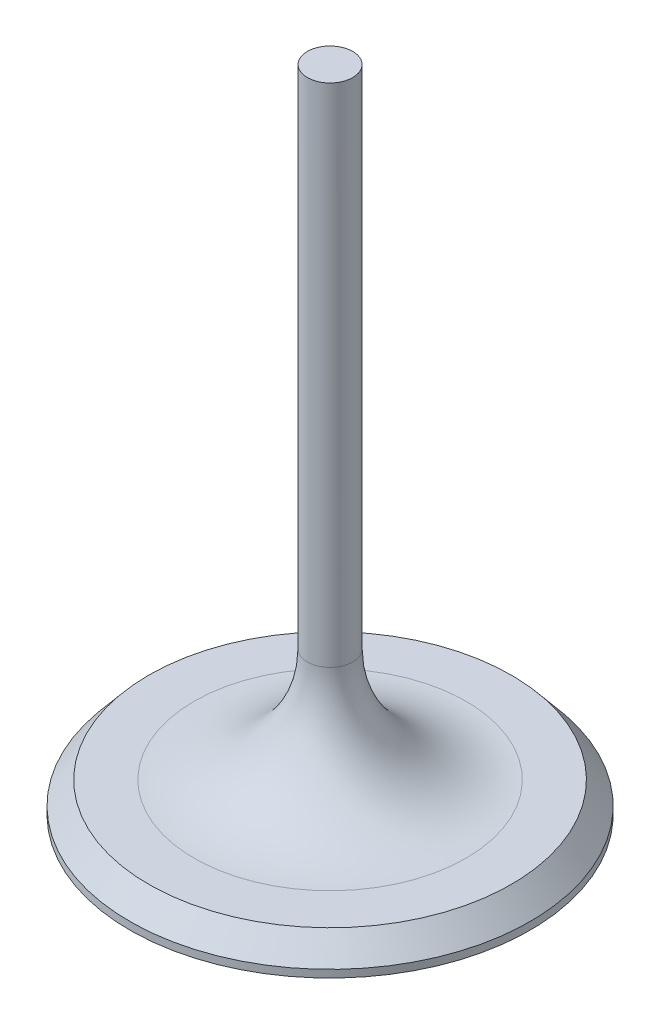
ISO-10303-21;
HEADER;
FILE_DESCRIPTION(('STEP AP214'),'2;1');
FILE_NAME('part.step','',(''),(''),'','','');
FILE_SCHEMA(('AUTOMOTIVE_DESIGN { 1 0 10303 214 1 1 1 1 }'));
ENDSEC;
DATA;
#1=APPLICATION_CONTEXT('core data for automotive mechanical design processes');
#2=APPLICATION_PROTOCOL_DEFINITION('international standard','automotive_design',2000,#1);
#3=PRODUCT_CONTEXT('',#1,'mechanical');
#4=PRODUCT('Part','Part','',(#3));
#5=PRODUCT_RELATED_PRODUCT_CATEGORY('part','',(#4));
#6=PRODUCT_DEFINITION_FORMATION('','',#4);
#7=PRODUCT_DEFINITION_CONTEXT('part definition',#1,'design');
#8=PRODUCT_DEFINITION('design','',#6,#7);
#9=PRODUCT_DEFINITION_SHAPE('','',#8);
#10=(LENGTH_UNIT() NAMED_UNIT(*) SI_UNIT(.MILLI.,.METRE.));
#11=(NAMED_UNIT(*) PLANE_ANGLE_UNIT() SI_UNIT($,.RADIAN.));
#12=(NAMED_UNIT(*) SI_UNIT($,.STERADIAN.) SOLID_ANGLE_UNIT());
#13=UNCERTAINTY_MEASURE_WITH_UNIT(LENGTH_MEASURE(1.E-05),#10,'distance_accuracy_value','');
#14=(GEOMETRIC_REPRESENTATION_CONTEXT(3) GLOBAL_UNCERTAINTY_ASSIGNED_CONTEXT((#13)) GLOBAL_UNIT_ASSIGNED_CONTEXT((#10,
#11,#12)) REPRESENTATION_CONTEXT('',''));
#15=CARTESIAN_POINT('',(0.,0.,0.));
#16=DIRECTION('',(0.,0.,1.));
#17=DIRECTION('',(1.,0.,0.));
#18=AXIS2_PLACEMENT_3D('',#15,#16,#17);
#19=CARTESIAN_POINT('',(3.,72.0921985815603,0.));
#20=DIRECTION('',(0.,-1.,0.));
#21=DIRECTION('',(1.,0.,0.));
#22=AXIS2_PLACEMENT_3D('',#19,#20,#21);
#23=PLANE('',#22);
#24=CARTESIAN_POINT('',(0.,72.0921985815603,0.));
#25=DIRECTION('',(0.,1.,0.));
#26=DIRECTION('',(-1.,0.,0.));
#27=AXIS2_PLACEMENT_3D('',#24,#25,#26);
#28=CIRCLE('',#27,3.);
#29=CARTESIAN_POINT('',(-3.,72.0921985815603,0.));
#30=VERTEX_POINT('',#29);
#31=EDGE_CURVE('E57',#30,#30,#28,.T.);
#32=ORIENTED_EDGE('',*,*,#31,.T.);
#33=EDGE_LOOP('',(#32));
#34=FACE_BOUND('',#33,.T.);
#35=ADVANCED_FACE('F34',(#34),#23,.F.);
#36=CARTESIAN_POINT('',(0.,-13.9078014184397,0.));
#37=DIRECTION('',(0.,1.,0.));
#38=DIRECTION('',(-1.,0.,0.));
#39=AXIS2_PLACEMENT_3D('',#36,#37,#38);
#40=PLANE('',#39);
#41=CARTESIAN_POINT('',(0.,-13.9078014184397,0.));
#42=DIRECTION('',(0.,1.,0.));
#43=DIRECTION('',(-1.,0.,0.));
#44=AXIS2_PLACEMENT_3D('',#41,#42,#43);
#45=CIRCLE('',#44,26.5);
#46=CARTESIAN_POINT('',(-26.5,-13.9078014184397,0.));
#47=VERTEX_POINT('',#46);
#48=EDGE_CURVE('E45',#47,#47,#45,.T.);
#49=ORIENTED_EDGE('',*,*,#48,.F.);
#50=EDGE_LOOP('',(#49));
#51=FACE_BOUND('',#50,.T.);
#52=ADVANCED_FACE('F74',(#51),#40,.F.);
#53=CARTESIAN_POINT('',(0.,72.0921985815603,0.));
#54=DIRECTION('',(0.,1.,0.));
#55=DIRECTION('',(-1.,0.,0.));
#56=AXIS2_PLACEMENT_3D('',#53,#54,#55);
#57=CYLINDRICAL_SURFACE('',#56,26.5);
#58=CARTESIAN_POINT('',(0.,-12.9078014184397,0.));
#59=DIRECTION('',(0.,1.,0.));
#60=DIRECTION('',(-1.,0.,0.));
#61=AXIS2_PLACEMENT_3D('',#58,#59,#60);
#62=CIRCLE('',#61,26.5);
#63=CARTESIAN_POINT('',(-26.5,-12.9078014184397,0.));
#64=VERTEX_POINT('',#63);
#65=EDGE_CURVE('E49',#64,#64,#62,.T.);
#66=ORIENTED_EDGE('',*,*,#65,.F.);
#67=EDGE_LOOP('',(#66));
#68=FACE_BOUND('',#67,.T.);
#69=ORIENTED_EDGE('',*,*,#48,.T.);
#70=EDGE_LOOP('',(#69));
#71=FACE_BOUND('',#70,.T.);
#72=ADVANCED_FACE('F78',(#68,#71),#57,.T.);
#73=CARTESIAN_POINT('',(0.,-12.9078014184397,0.));
#74=DIRECTION('',(0.,-1.,0.));
#75=DIRECTION('',(1.,0.,0.));
#76=AXIS2_PLACEMENT_3D('',#73,#74,#75);
#77=CONICAL_SURFACE('',#76,26.5,0.694738276196703);
#78=CARTESIAN_POINT('',(0.,-9.90780141843971,0.));
#79=DIRECTION('',(0.,1.,0.));
#80=DIRECTION('',(-1.,0.,0.));
#81=AXIS2_PLACEMENT_3D('',#78,#79,#80);
#82=CIRCLE('',#81,24.);
#83=CARTESIAN_POINT('',(-24.,-9.90780141843971,0.));
#84=VERTEX_POINT('',#83);
#85=EDGE_CURVE('E54',#84,#84,#82,.T.);
#86=ORIENTED_EDGE('',*,*,#85,.F.);
#87=EDGE_LOOP('',(#86));
#88=FACE_BOUND('',#87,.T.);
#89=ORIENTED_EDGE('',*,*,#65,.T.);
#90=EDGE_LOOP('',(#89));
#91=FACE_BOUND('',#90,.T.);
#92=ADVANCED_FACE('F71',(#88,#91),#77,.T.);
#93=CARTESIAN_POINT('',(3.,-9.90780141843971,0.));
#94=DIRECTION('',(0.,-1.,0.));
#95=DIRECTION('',(1.,0.,0.));
#96=AXIS2_PLACEMENT_3D('',#93,#94,#95);
#97=PLANE('',#96);
#98=CARTESIAN_POINT('',(0.,-9.90780141843971,0.));
#99=DIRECTION('',(0.,-1.,0.));
#100=DIRECTION('',(1.,0.,0.));
#101=AXIS2_PLACEMENT_3D('',#98,#99,#100);
#102=CIRCLE('',#101,18.);
#103=CARTESIAN_POINT('',(18.,-9.90780141843971,0.));
#104=VERTEX_POINT('',#103);
#105=EDGE_CURVE('E10',#104,#104,#102,.T.);
#106=ORIENTED_EDGE('',*,*,#105,.T.);
#107=EDGE_LOOP('',(#106));
#108=FACE_BOUND('',#107,.T.);
#109=ORIENTED_EDGE('',*,*,#85,.T.);
#110=EDGE_LOOP('',(#109));
#111=FACE_BOUND('',#110,.T.);
#112=ADVANCED_FACE('F64',(#108,#111),#97,.F.);
#113=CARTESIAN_POINT('',(0.,72.0921985815603,0.));
#114=DIRECTION('',(0.,1.,0.));
#115=DIRECTION('',(-1.,0.,0.));
#116=AXIS2_PLACEMENT_3D('',#113,#114,#115);
#117=CYLINDRICAL_SURFACE('',#116,3.);
#118=CARTESIAN_POINT('',(0.,5.09219858156029,0.));
#119=DIRECTION('',(0.,-1.,0.));
#120=DIRECTION('',(1.,0.,0.));
#121=AXIS2_PLACEMENT_3D('',#118,#119,#120);
#122=CIRCLE('',#121,3.);
#123=CARTESIAN_POINT('',(3.,5.09219858156029,0.));
#124=VERTEX_POINT('',#123);
#125=EDGE_CURVE('E41',#124,#124,#122,.F.);
#126=ORIENTED_EDGE('',*,*,#125,.T.);
#127=EDGE_LOOP('',(#126));
#128=FACE_BOUND('',#127,.T.);
#129=ORIENTED_EDGE('',*,*,#31,.F.);
#130=EDGE_LOOP('',(#129));
#131=FACE_BOUND('',#130,.T.);
#132=ADVANCED_FACE('F62',(#128,#131),#117,.T.);
#133=CARTESIAN_POINT('',(0.,5.09219858156029,0.));
#134=DIRECTION('',(0.,-1.,0.));
#135=DIRECTION('',(1.,0.,0.));
#136=AXIS2_PLACEMENT_3D('',#133,#134,#135);
#137=TOROIDAL_SURFACE('',#136,18.,15.);
#138=ORIENTED_EDGE('',*,*,#105,.F.);
#139=EDGE_LOOP('',(#138));
#140=FACE_BOUND('',#139,.T.);
#141=ORIENTED_EDGE('',*,*,#125,.F.);
#142=EDGE_LOOP('',(#141));
#143=FACE_BOUND('',#142,.T.);
#144=ADVANCED_FACE('F36',(#140,#143),#137,.F.);
#145=CLOSED_SHELL('',(#35,#52,#72,#92,#112,#132,#144));
#146=MANIFOLD_SOLID_BREP('B2',#145);
#147=ADVANCED_BREP_SHAPE_REPRESENTATION('',(#18,#146),#14);
#148=SHAPE_DEFINITION_REPRESENTATION(#9,#147);
ENDSEC;
END-ISO-10303-21;
